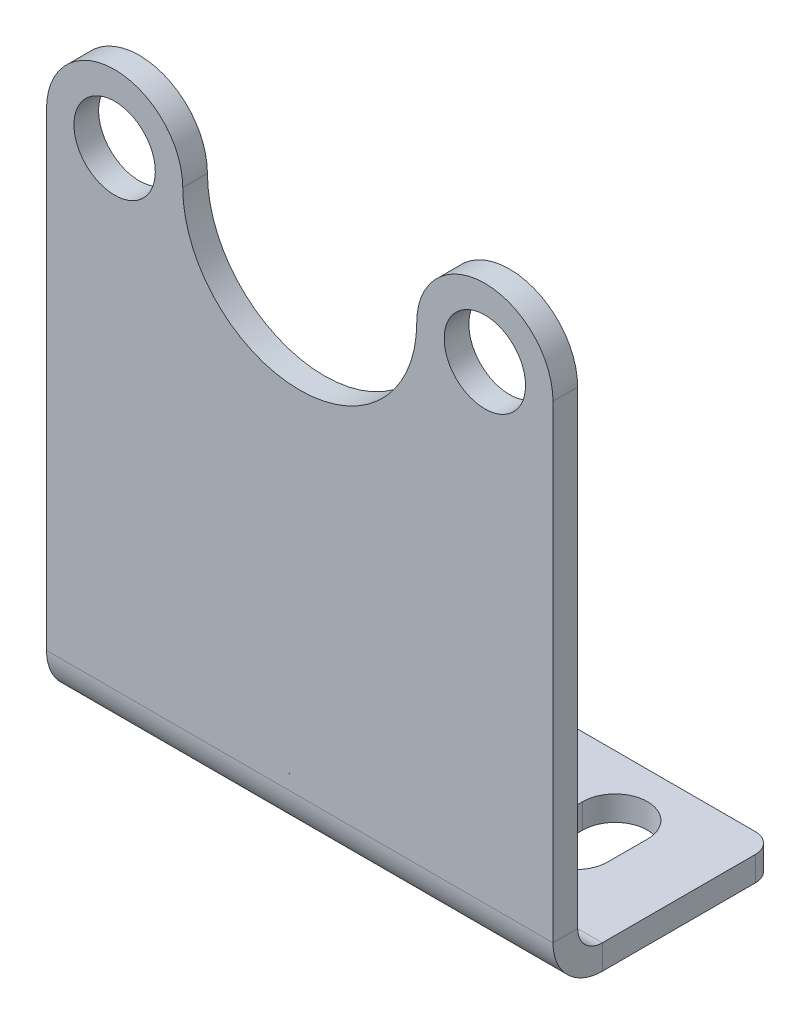
ISO-10303-21;
HEADER;
FILE_DESCRIPTION(('STEP AP214'),'2;1');
FILE_NAME('part.step','',(''),(''),'','','');
FILE_SCHEMA(('AUTOMOTIVE_DESIGN { 1 0 10303 214 1 1 1 1 }'));
ENDSEC;
DATA;
#1=APPLICATION_CONTEXT('core data for automotive mechanical design processes');
#2=APPLICATION_PROTOCOL_DEFINITION('international standard','automotive_design',2000,#1);
#3=PRODUCT_CONTEXT('',#1,'mechanical');
#4=PRODUCT('Part','Part','',(#3));
#5=PRODUCT_RELATED_PRODUCT_CATEGORY('part','',(#4));
#6=PRODUCT_DEFINITION_FORMATION('','',#4);
#7=PRODUCT_DEFINITION_CONTEXT('part definition',#1,'design');
#8=PRODUCT_DEFINITION('design','',#6,#7);
#9=PRODUCT_DEFINITION_SHAPE('','',#8);
#10=(LENGTH_UNIT() NAMED_UNIT(*) SI_UNIT(.MILLI.,.METRE.));
#11=(NAMED_UNIT(*) PLANE_ANGLE_UNIT() SI_UNIT($,.RADIAN.));
#12=(NAMED_UNIT(*) SI_UNIT($,.STERADIAN.) SOLID_ANGLE_UNIT());
#13=UNCERTAINTY_MEASURE_WITH_UNIT(LENGTH_MEASURE(1.E-05),#10,'distance_accuracy_value','');
#14=(GEOMETRIC_REPRESENTATION_CONTEXT(3) GLOBAL_UNCERTAINTY_ASSIGNED_CONTEXT((#13)) GLOBAL_UNIT_ASSIGNED_CONTEXT((#10,
#11,#12)) REPRESENTATION_CONTEXT('',''));
#15=CARTESIAN_POINT('',(0.,0.,0.));
#16=DIRECTION('',(0.,0.,1.));
#17=DIRECTION('',(1.,0.,0.));
#18=AXIS2_PLACEMENT_3D('',#15,#16,#17);
#19=CARTESIAN_POINT('',(-32.6263000000001,-14.5102681181538,0.));
#20=DIRECTION('',(-1.,0.,0.));
#21=DIRECTION('',(0.,-1.,0.));
#22=AXIS2_PLACEMENT_3D('',#19,#20,#21);
#23=PLANE('',#22);
#24=DIRECTION('',(0.,0.,-1.));
#25=VECTOR('',#24,1.);
#26=CARTESIAN_POINT('',(-32.6263000000001,-74.8352681181538,0.));
#27=LINE('',#26,#25);
#28=CARTESIAN_POINT('',(-32.6263000000001,-74.8352681181538,3.175));
#29=VERTEX_POINT('',#28);
#30=CARTESIAN_POINT('',(-32.6263000000001,-74.8352681181538,0.));
#31=VERTEX_POINT('',#30);
#32=EDGE_CURVE('E11',#29,#31,#27,.T.);
#33=ORIENTED_EDGE('',*,*,#32,.F.);
#34=DIRECTION('',(0.,1.,0.));
#35=VECTOR('',#34,1.);
#36=CARTESIAN_POINT('',(-32.6263000000001,-14.5102681181538,3.175));
#37=LINE('',#36,#35);
#38=CARTESIAN_POINT('',(-32.6263000000001,-14.5102681181538,3.175));
#39=VERTEX_POINT('',#38);
#40=EDGE_CURVE('E184',#39,#29,#37,.F.);
#41=ORIENTED_EDGE('',*,*,#40,.F.);
#42=DIRECTION('',(0.,0.,-1.));
#43=VECTOR('',#42,1.);
#44=CARTESIAN_POINT('',(-32.6263000000001,-14.5102681181538,0.));
#45=LINE('',#44,#43);
#46=CARTESIAN_POINT('',(-32.6263000000001,-14.5102681181538,0.));
#47=VERTEX_POINT('',#46);
#48=EDGE_CURVE('E51',#39,#47,#45,.T.);
#49=ORIENTED_EDGE('',*,*,#48,.T.);
#50=DIRECTION('',(0.,-1.,0.));
#51=VECTOR('',#50,1.);
#52=CARTESIAN_POINT('',(-32.6263000000001,-14.5102681181538,0.));
#53=LINE('',#52,#51);
#54=EDGE_CURVE('E251',#47,#31,#53,.T.);
#55=ORIENTED_EDGE('',*,*,#54,.T.);
#56=EDGE_LOOP('',(#33,#41,#49,#55));
#57=FACE_BOUND('',#56,.T.);
#58=ADVANCED_FACE('F41',(#57),#23,.T.);
#59=CARTESIAN_POINT('',(-23.8633000000001,-14.5102681181538,0.));
#60=DIRECTION('',(0.,0.,1.));
#61=DIRECTION('',(1.,0.,0.));
#62=AXIS2_PLACEMENT_3D('',#59,#60,#61);
#63=CYLINDRICAL_SURFACE('',#62,8.763);
#64=ORIENTED_EDGE('',*,*,#48,.F.);
#65=CARTESIAN_POINT('',(-23.8633000000001,-14.5102681181538,3.175));
#66=DIRECTION('',(0.,0.,1.));
#67=DIRECTION('',(1.,0.,0.));
#68=AXIS2_PLACEMENT_3D('',#65,#66,#67);
#69=CIRCLE('',#68,8.763);
#70=CARTESIAN_POINT('',(-15.1003000000001,-14.5102681181538,3.175));
#71=VERTEX_POINT('',#70);
#72=EDGE_CURVE('E192',#71,#39,#69,.T.);
#73=ORIENTED_EDGE('',*,*,#72,.F.);
#74=DIRECTION('',(0.,0.,-1.));
#75=VECTOR('',#74,1.);
#76=CARTESIAN_POINT('',(-15.1003000000001,-14.5102681181538,0.));
#77=LINE('',#76,#75);
#78=CARTESIAN_POINT('',(-15.1003000000001,-14.5102681181538,0.));
#79=VERTEX_POINT('',#78);
#80=EDGE_CURVE('E246',#71,#79,#77,.T.);
#81=ORIENTED_EDGE('',*,*,#80,.T.);
#82=CARTESIAN_POINT('',(-23.8633000000001,-14.5102681181538,0.));
#83=DIRECTION('',(0.,0.,1.));
#84=DIRECTION('',(1.,0.,0.));
#85=AXIS2_PLACEMENT_3D('',#82,#83,#84);
#86=CIRCLE('',#85,8.763);
#87=EDGE_CURVE('E264',#79,#47,#86,.T.);
#88=ORIENTED_EDGE('',*,*,#87,.T.);
#89=EDGE_LOOP('',(#64,#73,#81,#88));
#90=FACE_BOUND('',#89,.T.);
#91=ADVANCED_FACE('F270',(#90),#63,.T.);
#92=CARTESIAN_POINT('',(-0.0507999999999507,-14.5102681181538,0.));
#93=DIRECTION('',(0.,0.,1.));
#94=DIRECTION('',(1.,0.,0.));
#95=AXIS2_PLACEMENT_3D('',#92,#93,#94);
#96=CYLINDRICAL_SURFACE('',#95,15.0495000000001);
#97=ORIENTED_EDGE('',*,*,#80,.F.);
#98=CARTESIAN_POINT('',(-0.0507999999999507,-14.5102681181538,3.175));
#99=DIRECTION('',(0.,0.,-1.));
#100=DIRECTION('',(-1.,0.,0.));
#101=AXIS2_PLACEMENT_3D('',#98,#99,#100);
#102=CIRCLE('',#101,15.0495000000001);
#103=CARTESIAN_POINT('',(14.9987000000002,-14.5102681181538,3.175));
#104=VERTEX_POINT('',#103);
#105=EDGE_CURVE('E189',#104,#71,#102,.T.);
#106=ORIENTED_EDGE('',*,*,#105,.F.);
#107=DIRECTION('',(0.,0.,-1.));
#108=VECTOR('',#107,1.);
#109=CARTESIAN_POINT('',(14.9987000000002,-14.5102681181538,0.));
#110=LINE('',#109,#108);
#111=CARTESIAN_POINT('',(14.9987000000002,-14.5102681181538,0.));
#112=VERTEX_POINT('',#111);
#113=EDGE_CURVE('E243',#104,#112,#110,.T.);
#114=ORIENTED_EDGE('',*,*,#113,.T.);
#115=CARTESIAN_POINT('',(-0.0507999999999507,-14.5102681181538,0.));
#116=DIRECTION('',(0.,0.,-1.));
#117=DIRECTION('',(1.,0.,0.));
#118=AXIS2_PLACEMENT_3D('',#115,#116,#117);
#119=CIRCLE('',#118,15.0495000000001);
#120=EDGE_CURVE('E271',#112,#79,#119,.T.);
#121=ORIENTED_EDGE('',*,*,#120,.T.);
#122=EDGE_LOOP('',(#97,#106,#114,#121));
#123=FACE_BOUND('',#122,.T.);
#124=ADVANCED_FACE('F411',(#123),#96,.F.);
#125=CARTESIAN_POINT('',(23.7617000000002,-14.5102681181538,0.));
#126=DIRECTION('',(0.,0.,1.));
#127=DIRECTION('',(1.,0.,0.));
#128=AXIS2_PLACEMENT_3D('',#125,#126,#127);
#129=CYLINDRICAL_SURFACE('',#128,8.76299999999999);
#130=ORIENTED_EDGE('',*,*,#113,.F.);
#131=CARTESIAN_POINT('',(23.7617000000002,-14.5102681181538,3.175));
#132=DIRECTION('',(0.,0.,1.));
#133=DIRECTION('',(1.,0.,0.));
#134=AXIS2_PLACEMENT_3D('',#131,#132,#133);
#135=CIRCLE('',#134,8.76299999999999);
#136=CARTESIAN_POINT('',(32.5247000000001,-14.5102681181538,3.175));
#137=VERTEX_POINT('',#136);
#138=EDGE_CURVE('E185',#137,#104,#135,.T.);
#139=ORIENTED_EDGE('',*,*,#138,.F.);
#140=DIRECTION('',(0.,0.,-1.));
#141=VECTOR('',#140,1.);
#142=CARTESIAN_POINT('',(32.5247000000001,-14.5102681181538,0.));
#143=LINE('',#142,#141);
#144=CARTESIAN_POINT('',(32.5247000000001,-14.5102681181538,0.));
#145=VERTEX_POINT('',#144);
#146=EDGE_CURVE('E240',#137,#145,#143,.T.);
#147=ORIENTED_EDGE('',*,*,#146,.T.);
#148=CARTESIAN_POINT('',(23.7617000000002,-14.5102681181538,0.));
#149=DIRECTION('',(0.,0.,1.));
#150=DIRECTION('',(1.,0.,0.));
#151=AXIS2_PLACEMENT_3D('',#148,#149,#150);
#152=CIRCLE('',#151,8.76299999999999);
#153=EDGE_CURVE('E273',#145,#112,#152,.T.);
#154=ORIENTED_EDGE('',*,*,#153,.T.);
#155=EDGE_LOOP('',(#130,#139,#147,#154));
#156=FACE_BOUND('',#155,.T.);
#157=ADVANCED_FACE('F622',(#156),#129,.T.);
#158=CARTESIAN_POINT('',(32.5247000000002,-81.1852681181538,0.));
#159=DIRECTION('',(1.,0.,0.));
#160=DIRECTION('',(0.,1.,0.));
#161=AXIS2_PLACEMENT_3D('',#158,#159,#160);
#162=PLANE('',#161);
#163=ORIENTED_EDGE('',*,*,#146,.F.);
#164=DIRECTION('',(0.,1.,0.));
#165=VECTOR('',#164,1.);
#166=CARTESIAN_POINT('',(32.5247000000002,-14.5102681181538,3.175));
#167=LINE('',#166,#165);
#168=CARTESIAN_POINT('',(32.5247000000002,-74.8352681181538,3.175));
#169=VERTEX_POINT('',#168);
#170=EDGE_CURVE('E181',#169,#137,#167,.T.);
#171=ORIENTED_EDGE('',*,*,#170,.F.);
#172=DIRECTION('',(0.,0.,-1.));
#173=VECTOR('',#172,1.);
#174=CARTESIAN_POINT('',(32.5247000000002,-74.8352681181538,0.));
#175=LINE('',#174,#173);
#176=CARTESIAN_POINT('',(32.5247000000002,-74.8352681181538,0.));
#177=VERTEX_POINT('',#176);
#178=EDGE_CURVE('E237',#169,#177,#175,.T.);
#179=ORIENTED_EDGE('',*,*,#178,.T.);
#180=DIRECTION('',(0.,1.,0.));
#181=VECTOR('',#180,1.);
#182=CARTESIAN_POINT('',(32.5247000000002,-81.1852681181538,0.));
#183=LINE('',#182,#181);
#184=EDGE_CURVE('E268',#177,#145,#183,.T.);
#185=ORIENTED_EDGE('',*,*,#184,.T.);
#186=EDGE_LOOP('',(#163,#171,#179,#185));
#187=FACE_BOUND('',#186,.T.);
#188=ADVANCED_FACE('F404',(#187),#162,.T.);
#189=CARTESIAN_POINT('',(32.5247000000002,-74.8352681181538,-3.175));
#190=DIRECTION('',(1.,0.,0.));
#191=DIRECTION('',(0.,1.,0.));
#192=AXIS2_PLACEMENT_3D('',#189,#190,#191);
#193=PLANE('',#192);
#194=ORIENTED_EDGE('',*,*,#178,.F.);
#195=CARTESIAN_POINT('',(32.5247000000002,-74.8352681181538,-3.175));
#196=DIRECTION('',(-1.,0.,0.));
#197=DIRECTION('',(0.,0.,1.));
#198=AXIS2_PLACEMENT_3D('',#195,#196,#197);
#199=CIRCLE('',#198,6.35);
#200=CARTESIAN_POINT('',(32.5247000000002,-81.1852681181538,-3.175));
#201=VERTEX_POINT('',#200);
#202=EDGE_CURVE('E161',#169,#201,#199,.F.);
#203=ORIENTED_EDGE('',*,*,#202,.T.);
#204=DIRECTION('',(0.,1.,0.));
#205=VECTOR('',#204,1.);
#206=CARTESIAN_POINT('',(32.5247000000002,-78.0102681181538,-3.175));
#207=LINE('',#206,#205);
#208=CARTESIAN_POINT('',(32.5247000000002,-78.0102681181538,-3.175));
#209=VERTEX_POINT('',#208);
#210=EDGE_CURVE('E59',#201,#209,#207,.T.);
#211=ORIENTED_EDGE('',*,*,#210,.T.);
#212=CARTESIAN_POINT('',(32.5247000000002,-74.8352681181538,-3.175));
#213=DIRECTION('',(-1.,0.,0.));
#214=DIRECTION('',(0.,-1.,0.));
#215=AXIS2_PLACEMENT_3D('',#212,#213,#214);
#216=CIRCLE('',#215,3.175);
#217=EDGE_CURVE('E327',#177,#209,#216,.F.);
#218=ORIENTED_EDGE('',*,*,#217,.F.);
#219=EDGE_LOOP('',(#194,#203,#211,#218));
#220=FACE_BOUND('',#219,.T.);
#221=ADVANCED_FACE('F397',(#220),#193,.T.);
#222=CARTESIAN_POINT('',(32.5247000000002,-78.0102681181538,-25.4));
#223=DIRECTION('',(-1.,0.,0.));
#224=DIRECTION('',(0.,0.,1.));
#225=AXIS2_PLACEMENT_3D('',#222,#223,#224);
#226=PLANE('',#225);
#227=ORIENTED_EDGE('',*,*,#210,.F.);
#228=DIRECTION('',(0.,0.,1.));
#229=VECTOR('',#228,1.);
#230=CARTESIAN_POINT('',(32.5247000000002,-81.1852681181538,-25.4));
#231=LINE('',#230,#229);
#232=CARTESIAN_POINT('',(32.5247000000002,-81.1852681181538,-22.86));
#233=VERTEX_POINT('',#232);
#234=EDGE_CURVE('E153',#233,#201,#231,.T.);
#235=ORIENTED_EDGE('',*,*,#234,.F.);
#236=DIRECTION('',(0.,1.,0.));
#237=VECTOR('',#236,1.);
#238=CARTESIAN_POINT('',(32.5247000000002,-78.0102681181538,-22.86));
#239=LINE('',#238,#237);
#240=CARTESIAN_POINT('',(32.5247000000002,-78.0102681181538,-22.86));
#241=VERTEX_POINT('',#240);
#242=EDGE_CURVE('E233',#233,#241,#239,.T.);
#243=ORIENTED_EDGE('',*,*,#242,.T.);
#244=DIRECTION('',(0.,0.,1.));
#245=VECTOR('',#244,1.);
#246=CARTESIAN_POINT('',(32.5247000000002,-78.0102681181538,-25.4));
#247=LINE('',#246,#245);
#248=EDGE_CURVE('E317',#241,#209,#247,.T.);
#249=ORIENTED_EDGE('',*,*,#248,.T.);
#250=EDGE_LOOP('',(#227,#235,#243,#249));
#251=FACE_BOUND('',#250,.T.);
#252=ADVANCED_FACE('F395',(#251),#226,.F.);
#253=CARTESIAN_POINT('',(29.9847000000002,-78.0102681181538,-22.86));
#254=DIRECTION('',(0.,1.,0.));
#255=DIRECTION('',(0.,0.,1.));
#256=AXIS2_PLACEMENT_3D('',#253,#254,#255);
#257=CYLINDRICAL_SURFACE('',#256,2.54);
#258=ORIENTED_EDGE('',*,*,#242,.F.);
#259=CARTESIAN_POINT('',(29.9847000000002,-81.1852681181538,-22.86));
#260=DIRECTION('',(0.,1.,0.));
#261=DIRECTION('',(0.,0.,1.));
#262=AXIS2_PLACEMENT_3D('',#259,#260,#261);
#263=CIRCLE('',#262,2.54);
#264=CARTESIAN_POINT('',(29.9847000000002,-81.1852681181538,-25.4));
#265=VERTEX_POINT('',#264);
#266=EDGE_CURVE('E167',#233,#265,#263,.T.);
#267=ORIENTED_EDGE('',*,*,#266,.T.);
#268=DIRECTION('',(0.,1.,0.));
#269=VECTOR('',#268,1.);
#270=CARTESIAN_POINT('',(29.9847000000002,-78.0102681181538,-25.4));
#271=LINE('',#270,#269);
#272=CARTESIAN_POINT('',(29.9847000000002,-78.0102681181538,-25.4));
#273=VERTEX_POINT('',#272);
#274=EDGE_CURVE('E230',#265,#273,#271,.T.);
#275=ORIENTED_EDGE('',*,*,#274,.T.);
#276=CARTESIAN_POINT('',(29.9847000000002,-78.0102681181538,-22.86));
#277=DIRECTION('',(0.,1.,0.));
#278=DIRECTION('',(0.,0.,1.));
#279=AXIS2_PLACEMENT_3D('',#276,#277,#278);
#280=CIRCLE('',#279,2.54);
#281=EDGE_CURVE('E320',#241,#273,#280,.T.);
#282=ORIENTED_EDGE('',*,*,#281,.F.);
#283=EDGE_LOOP('',(#258,#267,#275,#282));
#284=FACE_BOUND('',#283,.T.);
#285=ADVANCED_FACE('F393',(#284),#257,.T.);
#286=CARTESIAN_POINT('',(32.5247000000002,-78.0102681181538,-25.4));
#287=DIRECTION('',(0.,0.,-1.));
#288=DIRECTION('',(-1.,0.,0.));
#289=AXIS2_PLACEMENT_3D('',#286,#287,#288);
#290=PLANE('',#289);
#291=ORIENTED_EDGE('',*,*,#274,.F.);
#292=DIRECTION('',(1.,0.,0.));
#293=VECTOR('',#292,1.);
#294=CARTESIAN_POINT('',(32.5247000000002,-81.1852681181538,-25.4));
#295=LINE('',#294,#293);
#296=CARTESIAN_POINT('',(-30.0863000000001,-81.1852681181538,-25.4));
#297=VERTEX_POINT('',#296);
#298=EDGE_CURVE('E169',#265,#297,#295,.F.);
#299=ORIENTED_EDGE('',*,*,#298,.T.);
#300=DIRECTION('',(0.,1.,0.));
#301=VECTOR('',#300,1.);
#302=CARTESIAN_POINT('',(-30.0863000000001,-78.0102681181538,-25.4));
#303=LINE('',#302,#301);
#304=CARTESIAN_POINT('',(-30.0863000000001,-78.0102681181538,-25.4));
#305=VERTEX_POINT('',#304);
#306=EDGE_CURVE('E227',#297,#305,#303,.T.);
#307=ORIENTED_EDGE('',*,*,#306,.T.);
#308=DIRECTION('',(-1.,0.,0.));
#309=VECTOR('',#308,1.);
#310=CARTESIAN_POINT('',(32.5247000000002,-78.0102681181538,-25.4));
#311=LINE('',#310,#309);
#312=EDGE_CURVE('E309',#273,#305,#311,.T.);
#313=ORIENTED_EDGE('',*,*,#312,.F.);
#314=EDGE_LOOP('',(#291,#299,#307,#313));
#315=FACE_BOUND('',#314,.T.);
#316=ADVANCED_FACE('F391',(#315),#290,.T.);
#317=CARTESIAN_POINT('',(-30.0863000000001,-78.0102681181538,-22.86));
#318=DIRECTION('',(0.,1.,0.));
#319=DIRECTION('',(0.,0.,1.));
#320=AXIS2_PLACEMENT_3D('',#317,#318,#319);
#321=CYLINDRICAL_SURFACE('',#320,2.54);
#322=ORIENTED_EDGE('',*,*,#306,.F.);
#323=CARTESIAN_POINT('',(-30.0863000000001,-81.1852681181538,-22.86));
#324=DIRECTION('',(0.,1.,0.));
#325=DIRECTION('',(0.,0.,1.));
#326=AXIS2_PLACEMENT_3D('',#323,#324,#325);
#327=CIRCLE('',#326,2.54);
#328=CARTESIAN_POINT('',(-32.6263000000001,-81.1852681181538,-22.86));
#329=VERTEX_POINT('',#328);
#330=EDGE_CURVE('E165',#297,#329,#327,.T.);
#331=ORIENTED_EDGE('',*,*,#330,.T.);
#332=DIRECTION('',(0.,1.,0.));
#333=VECTOR('',#332,1.);
#334=CARTESIAN_POINT('',(-32.6263000000001,-78.0102681181538,-22.86));
#335=LINE('',#334,#333);
#336=CARTESIAN_POINT('',(-32.6263000000001,-78.0102681181538,-22.86));
#337=VERTEX_POINT('',#336);
#338=EDGE_CURVE('E140',#329,#337,#335,.T.);
#339=ORIENTED_EDGE('',*,*,#338,.T.);
#340=CARTESIAN_POINT('',(-30.0863000000001,-78.0102681181538,-22.86));
#341=DIRECTION('',(0.,1.,0.));
#342=DIRECTION('',(0.,0.,1.));
#343=AXIS2_PLACEMENT_3D('',#340,#341,#342);
#344=CIRCLE('',#343,2.54);
#345=EDGE_CURVE('E312',#305,#337,#344,.T.);
#346=ORIENTED_EDGE('',*,*,#345,.F.);
#347=EDGE_LOOP('',(#322,#331,#339,#346));
#348=FACE_BOUND('',#347,.T.);
#349=ADVANCED_FACE('F388',(#348),#321,.T.);
#350=CARTESIAN_POINT('',(-32.6263000000001,-78.0102681181538,-25.4));
#351=DIRECTION('',(-1.,0.,0.));
#352=DIRECTION('',(0.,0.,1.));
#353=AXIS2_PLACEMENT_3D('',#350,#351,#352);
#354=PLANE('',#353);
#355=ORIENTED_EDGE('',*,*,#338,.F.);
#356=DIRECTION('',(0.,0.,1.));
#357=VECTOR('',#356,1.);
#358=CARTESIAN_POINT('',(-32.6263000000001,-81.1852681181538,-25.4));
#359=LINE('',#358,#357);
#360=CARTESIAN_POINT('',(-32.6263000000001,-81.1852681181538,-3.175));
#361=VERTEX_POINT('',#360);
#362=EDGE_CURVE('E149',#329,#361,#359,.T.);
#363=ORIENTED_EDGE('',*,*,#362,.T.);
#364=DIRECTION('',(0.,1.,0.));
#365=VECTOR('',#364,1.);
#366=CARTESIAN_POINT('',(-32.6263000000001,-78.0102681181538,-3.175));
#367=LINE('',#366,#365);
#368=CARTESIAN_POINT('',(-32.6263000000001,-78.0102681181538,-3.175));
#369=VERTEX_POINT('',#368);
#370=EDGE_CURVE('E45',#361,#369,#367,.T.);
#371=ORIENTED_EDGE('',*,*,#370,.T.);
#372=DIRECTION('',(0.,0.,1.));
#373=VECTOR('',#372,1.);
#374=CARTESIAN_POINT('',(-32.6263000000001,-78.0102681181538,-25.4));
#375=LINE('',#374,#373);
#376=EDGE_CURVE('E315',#337,#369,#375,.T.);
#377=ORIENTED_EDGE('',*,*,#376,.F.);
#378=EDGE_LOOP('',(#355,#363,#371,#377));
#379=FACE_BOUND('',#378,.T.);
#380=ADVANCED_FACE('F163',(#379),#354,.T.);
#381=CARTESIAN_POINT('',(-20.2946465845419,-78.0102681181538,-17.6342737517995));
#382=DIRECTION('',(0.,1.,0.));
#383=DIRECTION('',(0.,0.,1.));
#384=AXIS2_PLACEMENT_3D('',#381,#382,#383);
#385=CYLINDRICAL_SURFACE('',#384,4.1671875);
#386=DIRECTION('',(0.,1.,0.));
#387=VECTOR('',#386,1.);
#388=CARTESIAN_POINT('',(-24.4618340845419,-78.0102681181538,-17.6342737517995));
#389=LINE('',#388,#387);
#390=CARTESIAN_POINT('',(-24.4618340845419,-81.1852681181538,-17.6342737517995));
#391=VERTEX_POINT('',#390);
#392=CARTESIAN_POINT('',(-24.4618340845419,-78.0102681181538,-17.6342737517995));
#393=VERTEX_POINT('',#392);
#394=EDGE_CURVE('E141',#391,#393,#389,.T.);
#395=ORIENTED_EDGE('',*,*,#394,.F.);
#396=CARTESIAN_POINT('',(-20.2946465845419,-81.1852681181538,-17.6342737517995));
#397=DIRECTION('',(0.,1.,0.));
#398=DIRECTION('',(0.,0.,1.));
#399=AXIS2_PLACEMENT_3D('',#396,#397,#398);
#400=CIRCLE('',#399,4.1671875);
#401=CARTESIAN_POINT('',(-16.1274590845419,-81.1852681181538,-17.6342737517995));
#402=VERTEX_POINT('',#401);
#403=EDGE_CURVE('E345',#402,#391,#400,.T.);
#404=ORIENTED_EDGE('',*,*,#403,.F.);
#405=DIRECTION('',(0.,1.,0.));
#406=VECTOR('',#405,1.);
#407=CARTESIAN_POINT('',(-16.1274590845419,-78.0102681181538,-17.6342737517995));
#408=LINE('',#407,#406);
#409=CARTESIAN_POINT('',(-16.1274590845419,-78.0102681181538,-17.6342737517995));
#410=VERTEX_POINT('',#409);
#411=EDGE_CURVE('E219',#402,#410,#408,.T.);
#412=ORIENTED_EDGE('',*,*,#411,.T.);
#413=CARTESIAN_POINT('',(-20.2946465845419,-78.0102681181538,-17.6342737517995));
#414=DIRECTION('',(0.,1.,0.));
#415=DIRECTION('',(0.,0.,1.));
#416=AXIS2_PLACEMENT_3D('',#413,#414,#415);
#417=CIRCLE('',#416,4.1671875);
#418=EDGE_CURVE('E303',#410,#393,#417,.T.);
#419=ORIENTED_EDGE('',*,*,#418,.T.);
#420=EDGE_LOOP('',(#395,#404,#412,#419));
#421=FACE_BOUND('',#420,.T.);
#422=ADVANCED_FACE('F463',(#421),#385,.F.);
#423=CARTESIAN_POINT('',(-16.1274590845419,-78.0102681181538,-12.5542737517995));
#424=DIRECTION('',(1.,0.,0.));
#425=DIRECTION('',(0.,0.,-1.));
#426=AXIS2_PLACEMENT_3D('',#423,#424,#425);
#427=PLANE('',#426);
#428=ORIENTED_EDGE('',*,*,#411,.F.);
#429=DIRECTION('',(0.,0.,1.));
#430=VECTOR('',#429,1.);
#431=CARTESIAN_POINT('',(-16.1274590845419,-81.1852681181538,-25.4));
#432=LINE('',#431,#430);
#433=CARTESIAN_POINT('',(-16.1274590845419,-81.1852681181538,-12.5542737517995));
#434=VERTEX_POINT('',#433);
#435=EDGE_CURVE('E177',#434,#402,#432,.F.);
#436=ORIENTED_EDGE('',*,*,#435,.F.);
#437=DIRECTION('',(0.,1.,0.));
#438=VECTOR('',#437,1.);
#439=CARTESIAN_POINT('',(-16.1274590845419,-78.0102681181538,-12.5542737517995));
#440=LINE('',#439,#438);
#441=CARTESIAN_POINT('',(-16.1274590845419,-78.0102681181538,-12.5542737517995));
#442=VERTEX_POINT('',#441);
#443=EDGE_CURVE('E216',#434,#442,#440,.T.);
#444=ORIENTED_EDGE('',*,*,#443,.T.);
#445=DIRECTION('',(0.,0.,-1.));
#446=VECTOR('',#445,1.);
#447=CARTESIAN_POINT('',(-16.1274590845419,-78.0102681181538,-12.5542737517995));
#448=LINE('',#447,#446);
#449=EDGE_CURVE('E306',#442,#410,#448,.T.);
#450=ORIENTED_EDGE('',*,*,#449,.T.);
#451=EDGE_LOOP('',(#428,#436,#444,#450));
#452=FACE_BOUND('',#451,.T.);
#453=ADVANCED_FACE('F364',(#452),#427,.F.);
#454=CARTESIAN_POINT('',(-20.2946465845419,-78.0102681181538,-12.5542737517995));
#455=DIRECTION('',(0.,1.,0.));
#456=DIRECTION('',(0.,0.,1.));
#457=AXIS2_PLACEMENT_3D('',#454,#455,#456);
#458=CYLINDRICAL_SURFACE('',#457,4.1671875);
#459=ORIENTED_EDGE('',*,*,#443,.F.);
#460=CARTESIAN_POINT('',(-20.2946465845419,-81.1852681181538,-12.5542737517995));
#461=DIRECTION('',(0.,1.,0.));
#462=DIRECTION('',(0.,0.,1.));
#463=AXIS2_PLACEMENT_3D('',#460,#461,#462);
#464=CIRCLE('',#463,4.1671875);
#465=CARTESIAN_POINT('',(-24.4618340845419,-81.1852681181538,-12.5542737517995));
#466=VERTEX_POINT('',#465);
#467=EDGE_CURVE('E336',#466,#434,#464,.T.);
#468=ORIENTED_EDGE('',*,*,#467,.F.);
#469=DIRECTION('',(0.,1.,0.));
#470=VECTOR('',#469,1.);
#471=CARTESIAN_POINT('',(-24.4618340845419,-78.0102681181538,-12.5542737517995));
#472=LINE('',#471,#470);
#473=CARTESIAN_POINT('',(-24.4618340845419,-78.0102681181538,-12.5542737517995));
#474=VERTEX_POINT('',#473);
#475=EDGE_CURVE('E212',#466,#474,#472,.T.);
#476=ORIENTED_EDGE('',*,*,#475,.T.);
#477=CARTESIAN_POINT('',(-20.2946465845419,-78.0102681181538,-12.5542737517995));
#478=DIRECTION('',(0.,1.,0.));
#479=DIRECTION('',(0.,0.,1.));
#480=AXIS2_PLACEMENT_3D('',#477,#478,#479);
#481=CIRCLE('',#480,4.1671875);
#482=EDGE_CURVE('E297',#474,#442,#481,.T.);
#483=ORIENTED_EDGE('',*,*,#482,.T.);
#484=EDGE_LOOP('',(#459,#468,#476,#483));
#485=FACE_BOUND('',#484,.T.);
#486=ADVANCED_FACE('F358',(#485),#458,.F.);
#487=CARTESIAN_POINT('',(19.7053534154581,-78.0102681181538,-17.6342737517995));
#488=DIRECTION('',(0.,1.,0.));
#489=DIRECTION('',(0.,0.,1.));
#490=AXIS2_PLACEMENT_3D('',#487,#488,#489);
#491=CYLINDRICAL_SURFACE('',#490,4.1671875);
#492=DIRECTION('',(0.,1.,0.));
#493=VECTOR('',#492,1.);
#494=CARTESIAN_POINT('',(15.5381659154581,-78.0102681181538,-17.6342737517995));
#495=LINE('',#494,#493);
#496=CARTESIAN_POINT('',(15.5381659154581,-81.1852681181538,-17.6342737517995));
#497=VERTEX_POINT('',#496);
#498=CARTESIAN_POINT('',(15.5381659154581,-78.0102681181538,-17.6342737517995));
#499=VERTEX_POINT('',#498);
#500=EDGE_CURVE('E209',#497,#499,#495,.T.);
#501=ORIENTED_EDGE('',*,*,#500,.F.);
#502=CARTESIAN_POINT('',(19.7053534154581,-81.1852681181538,-17.6342737517995));
#503=DIRECTION('',(0.,1.,0.));
#504=DIRECTION('',(0.,0.,1.));
#505=AXIS2_PLACEMENT_3D('',#502,#503,#504);
#506=CIRCLE('',#505,4.1671875);
#507=CARTESIAN_POINT('',(23.8725409154581,-81.1852681181538,-17.6342737517995));
#508=VERTEX_POINT('',#507);
#509=EDGE_CURVE('E337',#508,#497,#506,.T.);
#510=ORIENTED_EDGE('',*,*,#509,.F.);
#511=DIRECTION('',(0.,1.,0.));
#512=VECTOR('',#511,1.);
#513=CARTESIAN_POINT('',(23.8725409154581,-78.0102681181538,-17.6342737517995));
#514=LINE('',#513,#512);
#515=CARTESIAN_POINT('',(23.8725409154581,-78.0102681181538,-17.6342737517995));
#516=VERTEX_POINT('',#515);
#517=EDGE_CURVE('E205',#508,#516,#514,.T.);
#518=ORIENTED_EDGE('',*,*,#517,.T.);
#519=CARTESIAN_POINT('',(19.7053534154581,-78.0102681181538,-17.6342737517995));
#520=DIRECTION('',(0.,1.,0.));
#521=DIRECTION('',(0.,0.,1.));
#522=AXIS2_PLACEMENT_3D('',#519,#520,#521);
#523=CIRCLE('',#522,4.1671875);
#524=EDGE_CURVE('E291',#516,#499,#523,.T.);
#525=ORIENTED_EDGE('',*,*,#524,.T.);
#526=EDGE_LOOP('',(#501,#510,#518,#525));
#527=FACE_BOUND('',#526,.T.);
#528=ADVANCED_FACE('F451',(#527),#491,.F.);
#529=CARTESIAN_POINT('',(23.8725409154581,-78.0102681181538,-12.5542737517995));
#530=DIRECTION('',(1.,0.,0.));
#531=DIRECTION('',(0.,0.,-1.));
#532=AXIS2_PLACEMENT_3D('',#529,#530,#531);
#533=PLANE('',#532);
#534=ORIENTED_EDGE('',*,*,#517,.F.);
#535=DIRECTION('',(0.,0.,1.));
#536=VECTOR('',#535,1.);
#537=CARTESIAN_POINT('',(23.8725409154581,-81.1852681181538,-25.4));
#538=LINE('',#537,#536);
#539=CARTESIAN_POINT('',(23.8725409154581,-81.1852681181538,-12.5542737517995));
#540=VERTEX_POINT('',#539);
#541=EDGE_CURVE('E333',#540,#508,#538,.F.);
#542=ORIENTED_EDGE('',*,*,#541,.F.);
#543=DIRECTION('',(0.,1.,0.));
#544=VECTOR('',#543,1.);
#545=CARTESIAN_POINT('',(23.8725409154581,-78.0102681181538,-12.5542737517995));
#546=LINE('',#545,#544);
#547=CARTESIAN_POINT('',(23.8725409154581,-78.0102681181538,-12.5542737517995));
#548=VERTEX_POINT('',#547);
#549=EDGE_CURVE('E202',#540,#548,#546,.T.);
#550=ORIENTED_EDGE('',*,*,#549,.T.);
#551=DIRECTION('',(0.,0.,-1.));
#552=VECTOR('',#551,1.);
#553=CARTESIAN_POINT('',(23.8725409154581,-78.0102681181538,-12.5542737517995));
#554=LINE('',#553,#552);
#555=EDGE_CURVE('E294',#548,#516,#554,.T.);
#556=ORIENTED_EDGE('',*,*,#555,.T.);
#557=EDGE_LOOP('',(#534,#542,#550,#556));
#558=FACE_BOUND('',#557,.T.);
#559=ADVANCED_FACE('F426',(#558),#533,.F.);
#560=CARTESIAN_POINT('',(19.7053534154581,-78.0102681181538,-12.5542737517995));
#561=DIRECTION('',(0.,1.,0.));
#562=DIRECTION('',(0.,0.,1.));
#563=AXIS2_PLACEMENT_3D('',#560,#561,#562);
#564=CYLINDRICAL_SURFACE('',#563,4.1671875);
#565=ORIENTED_EDGE('',*,*,#549,.F.);
#566=CARTESIAN_POINT('',(19.7053534154581,-81.1852681181538,-12.5542737517995));
#567=DIRECTION('',(0.,1.,0.));
#568=DIRECTION('',(0.,0.,1.));
#569=AXIS2_PLACEMENT_3D('',#566,#567,#568);
#570=CIRCLE('',#569,4.1671875);
#571=CARTESIAN_POINT('',(15.5381659154581,-81.1852681181538,-12.5542737517995));
#572=VERTEX_POINT('',#571);
#573=EDGE_CURVE('E201',#572,#540,#570,.T.);
#574=ORIENTED_EDGE('',*,*,#573,.F.);
#575=DIRECTION('',(0.,1.,0.));
#576=VECTOR('',#575,1.);
#577=CARTESIAN_POINT('',(15.5381659154581,-78.0102681181538,-12.5542737517995));
#578=LINE('',#577,#576);
#579=CARTESIAN_POINT('',(15.5381659154581,-78.0102681181538,-12.5542737517995));
#580=VERTEX_POINT('',#579);
#581=EDGE_CURVE('E206',#572,#580,#578,.T.);
#582=ORIENTED_EDGE('',*,*,#581,.T.);
#583=CARTESIAN_POINT('',(19.7053534154581,-78.0102681181538,-12.5542737517995));
#584=DIRECTION('',(0.,1.,0.));
#585=DIRECTION('',(0.,0.,1.));
#586=AXIS2_PLACEMENT_3D('',#583,#584,#585);
#587=CIRCLE('',#586,4.1671875);
#588=EDGE_CURVE('E285',#580,#548,#587,.T.);
#589=ORIENTED_EDGE('',*,*,#588,.T.);
#590=EDGE_LOOP('',(#565,#574,#582,#589));
#591=FACE_BOUND('',#590,.T.);
#592=ADVANCED_FACE('F418',(#591),#564,.F.);
#593=CARTESIAN_POINT('',(-23.8633000000001,-14.5102681181538,0.));
#594=DIRECTION('',(0.,0.,1.));
#595=DIRECTION('',(1.,0.,0.));
#596=AXIS2_PLACEMENT_3D('',#593,#594,#595);
#597=CYLINDRICAL_SURFACE('',#596,5.2324);
#598=CARTESIAN_POINT('',(-23.8633000000001,-14.5102681181538,0.));
#599=DIRECTION('',(0.,0.,1.));
#600=DIRECTION('',(1.,0.,0.));
#601=AXIS2_PLACEMENT_3D('',#598,#599,#600);
#602=CIRCLE('',#601,5.2324);
#603=CARTESIAN_POINT('',(-18.6309000000001,-14.5102681181538,0.));
#604=VERTEX_POINT('',#603);
#605=EDGE_CURVE('E279',#604,#604,#602,.T.);
#606=ORIENTED_EDGE('',*,*,#605,.F.);
#607=EDGE_LOOP('',(#606));
#608=FACE_BOUND('',#607,.T.);
#609=CARTESIAN_POINT('',(-23.8633000000001,-14.5102681181538,3.175));
#610=DIRECTION('',(0.,0.,1.));
#611=DIRECTION('',(1.,0.,0.));
#612=AXIS2_PLACEMENT_3D('',#609,#610,#611);
#613=CIRCLE('',#612,5.2324);
#614=CARTESIAN_POINT('',(-18.6309000000001,-14.5102681181538,3.175));
#615=VERTEX_POINT('',#614);
#616=EDGE_CURVE('E188',#615,#615,#613,.T.);
#617=ORIENTED_EDGE('',*,*,#616,.T.);
#618=EDGE_LOOP('',(#617));
#619=FACE_BOUND('',#618,.T.);
#620=ADVANCED_FACE('F416',(#608,#619),#597,.F.);
#621=CARTESIAN_POINT('',(23.7617000000002,-14.5102681181538,0.));
#622=DIRECTION('',(0.,0.,1.));
#623=DIRECTION('',(1.,0.,0.));
#624=AXIS2_PLACEMENT_3D('',#621,#622,#623);
#625=CYLINDRICAL_SURFACE('',#624,5.2324);
#626=CARTESIAN_POINT('',(23.7617000000002,-14.5102681181538,0.));
#627=DIRECTION('',(0.,0.,1.));
#628=DIRECTION('',(1.,0.,0.));
#629=AXIS2_PLACEMENT_3D('',#626,#627,#628);
#630=CIRCLE('',#629,5.2324);
#631=CARTESIAN_POINT('',(28.9941000000002,-14.5102681181538,0.));
#632=VERTEX_POINT('',#631);
#633=EDGE_CURVE('E282',#632,#632,#630,.T.);
#634=ORIENTED_EDGE('',*,*,#633,.F.);
#635=EDGE_LOOP('',(#634));
#636=FACE_BOUND('',#635,.T.);
#637=CARTESIAN_POINT('',(23.7617000000002,-14.5102681181538,3.175));
#638=DIRECTION('',(0.,0.,1.));
#639=DIRECTION('',(1.,0.,0.));
#640=AXIS2_PLACEMENT_3D('',#637,#638,#639);
#641=CIRCLE('',#640,5.2324);
#642=CARTESIAN_POINT('',(28.9941000000002,-14.5102681181538,3.175));
#643=VERTEX_POINT('',#642);
#644=EDGE_CURVE('E198',#643,#643,#641,.T.);
#645=ORIENTED_EDGE('',*,*,#644,.T.);
#646=EDGE_LOOP('',(#645));
#647=FACE_BOUND('',#646,.T.);
#648=ADVANCED_FACE('F43',(#636,#647),#625,.F.);
#649=CARTESIAN_POINT('',(15.5381659154581,-78.0102681181538,-12.5542737517995));
#650=DIRECTION('',(1.,0.,0.));
#651=DIRECTION('',(0.,0.,-1.));
#652=AXIS2_PLACEMENT_3D('',#649,#650,#651);
#653=PLANE('',#652);
#654=DIRECTION('',(0.,0.,1.));
#655=VECTOR('',#654,1.);
#656=CARTESIAN_POINT('',(15.5381659154581,-81.1852681181538,-25.4));
#657=LINE('',#656,#655);
#658=EDGE_CURVE('E332',#572,#497,#657,.F.);
#659=ORIENTED_EDGE('',*,*,#658,.T.);
#660=ORIENTED_EDGE('',*,*,#500,.T.);
#661=DIRECTION('',(0.,0.,-1.));
#662=VECTOR('',#661,1.);
#663=CARTESIAN_POINT('',(15.5381659154581,-78.0102681181538,-12.5542737517995));
#664=LINE('',#663,#662);
#665=EDGE_CURVE('E288',#580,#499,#664,.T.);
#666=ORIENTED_EDGE('',*,*,#665,.F.);
#667=ORIENTED_EDGE('',*,*,#581,.F.);
#668=EDGE_LOOP('',(#659,#660,#666,#667));
#669=FACE_BOUND('',#668,.T.);
#670=ADVANCED_FACE('F424',(#669),#653,.T.);
#671=CARTESIAN_POINT('',(-24.4618340845419,-78.0102681181538,-12.5542737517995));
#672=DIRECTION('',(1.,0.,0.));
#673=DIRECTION('',(0.,0.,-1.));
#674=AXIS2_PLACEMENT_3D('',#671,#672,#673);
#675=PLANE('',#674);
#676=DIRECTION('',(0.,0.,1.));
#677=VECTOR('',#676,1.);
#678=CARTESIAN_POINT('',(-24.4618340845419,-81.1852681181538,-25.4));
#679=LINE('',#678,#677);
#680=EDGE_CURVE('E172',#466,#391,#679,.F.);
#681=ORIENTED_EDGE('',*,*,#680,.T.);
#682=ORIENTED_EDGE('',*,*,#394,.T.);
#683=DIRECTION('',(0.,0.,-1.));
#684=VECTOR('',#683,1.);
#685=CARTESIAN_POINT('',(-24.4618340845419,-78.0102681181538,-12.5542737517995));
#686=LINE('',#685,#684);
#687=EDGE_CURVE('E300',#474,#393,#686,.T.);
#688=ORIENTED_EDGE('',*,*,#687,.F.);
#689=ORIENTED_EDGE('',*,*,#475,.F.);
#690=EDGE_LOOP('',(#681,#682,#688,#689));
#691=FACE_BOUND('',#690,.T.);
#692=ADVANCED_FACE('F352',(#691),#675,.T.);
#693=CARTESIAN_POINT('',(-32.6263000000001,-74.8352681181538,-3.175));
#694=DIRECTION('',(1.,0.,0.));
#695=DIRECTION('',(0.,1.,0.));
#696=AXIS2_PLACEMENT_3D('',#693,#694,#695);
#697=PLANE('',#696);
#698=CARTESIAN_POINT('',(-32.6263000000001,-74.8352681181538,-3.175));
#699=DIRECTION('',(-1.,0.,0.));
#700=DIRECTION('',(0.,0.,1.));
#701=AXIS2_PLACEMENT_3D('',#698,#699,#700);
#702=CIRCLE('',#701,6.35);
#703=EDGE_CURVE('E132',#361,#29,#702,.T.);
#704=ORIENTED_EDGE('',*,*,#703,.T.);
#705=ORIENTED_EDGE('',*,*,#32,.T.);
#706=CARTESIAN_POINT('',(-32.6263000000001,-74.8352681181538,-3.175));
#707=DIRECTION('',(-1.,0.,0.));
#708=DIRECTION('',(0.,-1.,0.));
#709=AXIS2_PLACEMENT_3D('',#706,#707,#708);
#710=CIRCLE('',#709,3.175);
#711=EDGE_CURVE('E134',#369,#31,#710,.T.);
#712=ORIENTED_EDGE('',*,*,#711,.F.);
#713=ORIENTED_EDGE('',*,*,#370,.F.);
#714=EDGE_LOOP('',(#704,#705,#712,#713));
#715=FACE_BOUND('',#714,.T.);
#716=ADVANCED_FACE('F130',(#715),#697,.F.);
#717=CARTESIAN_POINT('',(32.5247000000002,-78.0102681181538,-25.4));
#718=DIRECTION('',(0.,1.,0.));
#719=DIRECTION('',(0.,0.,1.));
#720=AXIS2_PLACEMENT_3D('',#717,#718,#719);
#721=PLANE('',#720);
#722=ORIENTED_EDGE('',*,*,#588,.F.);
#723=ORIENTED_EDGE('',*,*,#665,.T.);
#724=ORIENTED_EDGE('',*,*,#524,.F.);
#725=ORIENTED_EDGE('',*,*,#555,.F.);
#726=EDGE_LOOP('',(#722,#723,#724,#725));
#727=FACE_BOUND('',#726,.T.);
#728=ORIENTED_EDGE('',*,*,#482,.F.);
#729=ORIENTED_EDGE('',*,*,#687,.T.);
#730=ORIENTED_EDGE('',*,*,#418,.F.);
#731=ORIENTED_EDGE('',*,*,#449,.F.);
#732=EDGE_LOOP('',(#728,#729,#730,#731));
#733=FACE_BOUND('',#732,.T.);
#734=ORIENTED_EDGE('',*,*,#376,.T.);
#735=DIRECTION('',(-1.,0.,0.));
#736=VECTOR('',#735,1.);
#737=CARTESIAN_POINT('',(32.5247000000002,-78.0102681181538,-3.175));
#738=LINE('',#737,#736);
#739=EDGE_CURVE('E215',#369,#209,#738,.F.);
#740=ORIENTED_EDGE('',*,*,#739,.T.);
#741=ORIENTED_EDGE('',*,*,#248,.F.);
#742=ORIENTED_EDGE('',*,*,#281,.T.);
#743=ORIENTED_EDGE('',*,*,#312,.T.);
#744=ORIENTED_EDGE('',*,*,#345,.T.);
#745=EDGE_LOOP('',(#734,#740,#741,#742,#743,#744));
#746=FACE_BOUND('',#745,.T.);
#747=ADVANCED_FACE('F383',(#727,#733,#746),#721,.T.);
#748=CARTESIAN_POINT('',(23.7617000000002,-14.5102681181538,0.));
#749=DIRECTION('',(0.,0.,1.));
#750=DIRECTION('',(1.,0.,0.));
#751=AXIS2_PLACEMENT_3D('',#748,#749,#750);
#752=PLANE('',#751);
#753=ORIENTED_EDGE('',*,*,#184,.F.);
#754=DIRECTION('',(-1.,0.,0.));
#755=VECTOR('',#754,1.);
#756=CARTESIAN_POINT('',(23.7617000000002,-74.8352681181538,0.));
#757=LINE('',#756,#755);
#758=EDGE_CURVE('E267',#177,#31,#757,.T.);
#759=ORIENTED_EDGE('',*,*,#758,.T.);
#760=ORIENTED_EDGE('',*,*,#54,.F.);
#761=ORIENTED_EDGE('',*,*,#87,.F.);
#762=ORIENTED_EDGE('',*,*,#120,.F.);
#763=ORIENTED_EDGE('',*,*,#153,.F.);
#764=EDGE_LOOP('',(#753,#759,#760,#761,#762,#763));
#765=FACE_BOUND('',#764,.T.);
#766=ORIENTED_EDGE('',*,*,#605,.T.);
#767=EDGE_LOOP('',(#766));
#768=FACE_BOUND('',#767,.T.);
#769=ORIENTED_EDGE('',*,*,#633,.T.);
#770=EDGE_LOOP('',(#769));
#771=FACE_BOUND('',#770,.T.);
#772=ADVANCED_FACE('F261',(#765,#768,#771),#752,.F.);
#773=CARTESIAN_POINT('',(23.7617000000002,-74.8352681181538,-3.175));
#774=DIRECTION('',(-1.,0.,0.));
#775=DIRECTION('',(0.,0.,1.));
#776=AXIS2_PLACEMENT_3D('',#773,#774,#775);
#777=CYLINDRICAL_SURFACE('',#776,3.175);
#778=ORIENTED_EDGE('',*,*,#217,.T.);
#779=ORIENTED_EDGE('',*,*,#739,.F.);
#780=ORIENTED_EDGE('',*,*,#711,.T.);
#781=ORIENTED_EDGE('',*,*,#758,.F.);
#782=EDGE_LOOP('',(#778,#779,#780,#781));
#783=FACE_BOUND('',#782,.T.);
#784=ADVANCED_FACE('F380',(#783),#777,.F.);
#785=CARTESIAN_POINT('',(32.5247000000002,-81.1852681181538,-25.4));
#786=DIRECTION('',(0.,1.,0.));
#787=DIRECTION('',(0.,0.,1.));
#788=AXIS2_PLACEMENT_3D('',#785,#786,#787);
#789=PLANE('',#788);
#790=ORIENTED_EDGE('',*,*,#573,.T.);
#791=ORIENTED_EDGE('',*,*,#541,.T.);
#792=ORIENTED_EDGE('',*,*,#509,.T.);
#793=ORIENTED_EDGE('',*,*,#658,.F.);
#794=EDGE_LOOP('',(#790,#791,#792,#793));
#795=FACE_BOUND('',#794,.T.);
#796=ORIENTED_EDGE('',*,*,#467,.T.);
#797=ORIENTED_EDGE('',*,*,#435,.T.);
#798=ORIENTED_EDGE('',*,*,#403,.T.);
#799=ORIENTED_EDGE('',*,*,#680,.F.);
#800=EDGE_LOOP('',(#796,#797,#798,#799));
#801=FACE_BOUND('',#800,.T.);
#802=ORIENTED_EDGE('',*,*,#362,.F.);
#803=ORIENTED_EDGE('',*,*,#330,.F.);
#804=ORIENTED_EDGE('',*,*,#298,.F.);
#805=ORIENTED_EDGE('',*,*,#266,.F.);
#806=ORIENTED_EDGE('',*,*,#234,.T.);
#807=DIRECTION('',(1.,0.,0.));
#808=VECTOR('',#807,1.);
#809=CARTESIAN_POINT('',(32.5247000000002,-81.1852681181538,-3.175));
#810=LINE('',#809,#808);
#811=EDGE_CURVE('E146',#361,#201,#810,.T.);
#812=ORIENTED_EDGE('',*,*,#811,.F.);
#813=EDGE_LOOP('',(#802,#803,#804,#805,#806,#812));
#814=FACE_BOUND('',#813,.T.);
#815=ADVANCED_FACE('F147',(#795,#801,#814),#789,.F.);
#816=CARTESIAN_POINT('',(23.7617000000002,-14.5102681181538,3.175));
#817=DIRECTION('',(0.,0.,1.));
#818=DIRECTION('',(1.,0.,0.));
#819=AXIS2_PLACEMENT_3D('',#816,#817,#818);
#820=PLANE('',#819);
#821=ORIENTED_EDGE('',*,*,#170,.T.);
#822=ORIENTED_EDGE('',*,*,#138,.T.);
#823=ORIENTED_EDGE('',*,*,#105,.T.);
#824=ORIENTED_EDGE('',*,*,#72,.T.);
#825=ORIENTED_EDGE('',*,*,#40,.T.);
#826=DIRECTION('',(1.,0.,0.));
#827=VECTOR('',#826,1.);
#828=CARTESIAN_POINT('',(23.7617000000002,-74.8352681181538,3.175));
#829=LINE('',#828,#827);
#830=EDGE_CURVE('E156',#169,#29,#829,.F.);
#831=ORIENTED_EDGE('',*,*,#830,.F.);
#832=EDGE_LOOP('',(#821,#822,#823,#824,#825,#831));
#833=FACE_BOUND('',#832,.T.);
#834=ORIENTED_EDGE('',*,*,#616,.F.);
#835=EDGE_LOOP('',(#834));
#836=FACE_BOUND('',#835,.T.);
#837=ORIENTED_EDGE('',*,*,#644,.F.);
#838=EDGE_LOOP('',(#837));
#839=FACE_BOUND('',#838,.T.);
#840=ADVANCED_FACE('F433',(#833,#836,#839),#820,.T.);
#841=CARTESIAN_POINT('',(23.7617000000002,-74.8352681181538,-3.175));
#842=DIRECTION('',(-1.,0.,0.));
#843=DIRECTION('',(0.,0.,1.));
#844=AXIS2_PLACEMENT_3D('',#841,#842,#843);
#845=CYLINDRICAL_SURFACE('',#844,6.35);
#846=ORIENTED_EDGE('',*,*,#202,.F.);
#847=ORIENTED_EDGE('',*,*,#830,.T.);
#848=ORIENTED_EDGE('',*,*,#703,.F.);
#849=ORIENTED_EDGE('',*,*,#811,.T.);
#850=EDGE_LOOP('',(#846,#847,#848,#849));
#851=FACE_BOUND('',#850,.T.);
#852=ADVANCED_FACE('F158',(#851),#845,.T.);
#853=CLOSED_SHELL('',(#58,#91,#124,#157,#188,#221,#252,#285,#316,#349,#380,#422,#453,#486,#528,
#559,#592,#620,#648,#670,#692,#716,#747,#772,#784,#815,#840,#852));
#854=MANIFOLD_SOLID_BREP('B2',#853);
#855=ADVANCED_BREP_SHAPE_REPRESENTATION('',(#18,#854),#14);
#856=SHAPE_DEFINITION_REPRESENTATION(#9,#855);
ENDSEC;
END-ISO-10303-21;
